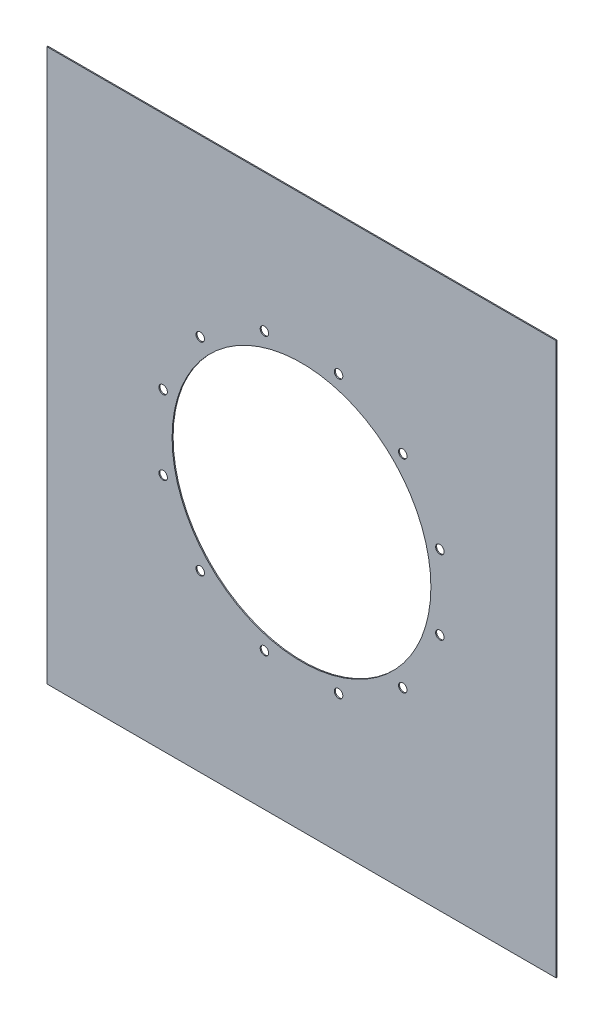
ISO-10303-21;
HEADER;
FILE_DESCRIPTION(('STEP AP214'),'2;1');
FILE_NAME('part.step','',(''),(''),'','','');
FILE_SCHEMA(('AUTOMOTIVE_DESIGN { 1 0 10303 214 1 1 1 1 }'));
ENDSEC;
DATA;
#1=APPLICATION_CONTEXT('core data for automotive mechanical design processes');
#2=APPLICATION_PROTOCOL_DEFINITION('international standard','automotive_design',2000,#1);
#3=PRODUCT_CONTEXT('',#1,'mechanical');
#4=PRODUCT('Part','Part','',(#3));
#5=PRODUCT_RELATED_PRODUCT_CATEGORY('part','',(#4));
#6=PRODUCT_DEFINITION_FORMATION('','',#4);
#7=PRODUCT_DEFINITION_CONTEXT('part definition',#1,'design');
#8=PRODUCT_DEFINITION('design','',#6,#7);
#9=PRODUCT_DEFINITION_SHAPE('','',#8);
#10=(LENGTH_UNIT() NAMED_UNIT(*) SI_UNIT(.MILLI.,.METRE.));
#11=(NAMED_UNIT(*) PLANE_ANGLE_UNIT() SI_UNIT($,.RADIAN.));
#12=(NAMED_UNIT(*) SI_UNIT($,.STERADIAN.) SOLID_ANGLE_UNIT());
#13=UNCERTAINTY_MEASURE_WITH_UNIT(LENGTH_MEASURE(1.E-05),#10,'distance_accuracy_value','');
#14=(GEOMETRIC_REPRESENTATION_CONTEXT(3) GLOBAL_UNCERTAINTY_ASSIGNED_CONTEXT((#13)) GLOBAL_UNIT_ASSIGNED_CONTEXT((#10,
#11,#12)) REPRESENTATION_CONTEXT('',''));
#15=CARTESIAN_POINT('',(0.,0.,0.));
#16=DIRECTION('',(0.,0.,1.));
#17=DIRECTION('',(1.,0.,0.));
#18=AXIS2_PLACEMENT_3D('',#15,#16,#17);
#19=CARTESIAN_POINT('',(-300.,-325.,-1.2));
#20=DIRECTION('',(-1.,0.,0.));
#21=DIRECTION('',(0.,0.,1.));
#22=AXIS2_PLACEMENT_3D('',#19,#20,#21);
#23=PLANE('',#22);
#24=DIRECTION('',(0.,-1.,0.));
#25=VECTOR('',#24,1.);
#26=CARTESIAN_POINT('',(-300.,-325.,0.));
#27=LINE('',#26,#25);
#28=CARTESIAN_POINT('',(-300.,325.,0.));
#29=VERTEX_POINT('',#28);
#30=CARTESIAN_POINT('',(-300.,-325.,0.));
#31=VERTEX_POINT('',#30);
#32=EDGE_CURVE('E108',#29,#31,#27,.T.);
#33=ORIENTED_EDGE('',*,*,#32,.F.);
#34=DIRECTION('',(0.,0.,1.));
#35=VECTOR('',#34,1.);
#36=CARTESIAN_POINT('',(-300.,325.,-1.2));
#37=LINE('',#36,#35);
#38=CARTESIAN_POINT('',(-300.,325.,-1.2));
#39=VERTEX_POINT('',#38);
#40=EDGE_CURVE('E11',#39,#29,#37,.T.);
#41=ORIENTED_EDGE('',*,*,#40,.F.);
#42=DIRECTION('',(0.,-1.,0.));
#43=VECTOR('',#42,1.);
#44=CARTESIAN_POINT('',(-300.,-325.,-1.2));
#45=LINE('',#44,#43);
#46=CARTESIAN_POINT('',(-300.,-325.,-1.2));
#47=VERTEX_POINT('',#46);
#48=EDGE_CURVE('E101',#39,#47,#45,.T.);
#49=ORIENTED_EDGE('',*,*,#48,.T.);
#50=DIRECTION('',(0.,0.,1.));
#51=VECTOR('',#50,1.);
#52=CARTESIAN_POINT('',(-300.,-325.,-1.2));
#53=LINE('',#52,#51);
#54=EDGE_CURVE('E46',#47,#31,#53,.T.);
#55=ORIENTED_EDGE('',*,*,#54,.T.);
#56=EDGE_LOOP('',(#33,#41,#49,#55));
#57=FACE_BOUND('',#56,.T.);
#58=ADVANCED_FACE('F43',(#57),#23,.T.);
#59=CARTESIAN_POINT('',(300.,325.,-1.2));
#60=DIRECTION('',(0.,1.,0.));
#61=DIRECTION('',(-1.,0.,0.));
#62=AXIS2_PLACEMENT_3D('',#59,#60,#61);
#63=PLANE('',#62);
#64=DIRECTION('',(-1.,0.,0.));
#65=VECTOR('',#64,1.);
#66=CARTESIAN_POINT('',(300.,325.,0.));
#67=LINE('',#66,#65);
#68=CARTESIAN_POINT('',(300.,325.,0.));
#69=VERTEX_POINT('',#68);
#70=EDGE_CURVE('E103',#69,#29,#67,.T.);
#71=ORIENTED_EDGE('',*,*,#70,.F.);
#72=DIRECTION('',(0.,0.,1.));
#73=VECTOR('',#72,1.);
#74=CARTESIAN_POINT('',(300.,325.,-1.2));
#75=LINE('',#74,#73);
#76=CARTESIAN_POINT('',(300.,325.,-1.2));
#77=VERTEX_POINT('',#76);
#78=EDGE_CURVE('E52',#77,#69,#75,.T.);
#79=ORIENTED_EDGE('',*,*,#78,.F.);
#80=DIRECTION('',(-1.,0.,0.));
#81=VECTOR('',#80,1.);
#82=CARTESIAN_POINT('',(300.,325.,-1.2));
#83=LINE('',#82,#81);
#84=EDGE_CURVE('E98',#77,#39,#83,.T.);
#85=ORIENTED_EDGE('',*,*,#84,.T.);
#86=ORIENTED_EDGE('',*,*,#40,.T.);
#87=EDGE_LOOP('',(#71,#79,#85,#86));
#88=FACE_BOUND('',#87,.T.);
#89=ADVANCED_FACE('F119',(#88),#63,.T.);
#90=CARTESIAN_POINT('',(300.,-325.,-1.2));
#91=DIRECTION('',(1.,0.,0.));
#92=DIRECTION('',(0.,0.,-1.));
#93=AXIS2_PLACEMENT_3D('',#90,#91,#92);
#94=PLANE('',#93);
#95=DIRECTION('',(0.,1.,0.));
#96=VECTOR('',#95,1.);
#97=CARTESIAN_POINT('',(300.,-325.,0.));
#98=LINE('',#97,#96);
#99=CARTESIAN_POINT('',(300.,-325.,0.));
#100=VERTEX_POINT('',#99);
#101=EDGE_CURVE('E93',#100,#69,#98,.T.);
#102=ORIENTED_EDGE('',*,*,#101,.F.);
#103=DIRECTION('',(0.,0.,1.));
#104=VECTOR('',#103,1.);
#105=CARTESIAN_POINT('',(300.,-325.,-1.2));
#106=LINE('',#105,#104);
#107=CARTESIAN_POINT('',(300.,-325.,-1.2));
#108=VERTEX_POINT('',#107);
#109=EDGE_CURVE('E88',#108,#100,#106,.T.);
#110=ORIENTED_EDGE('',*,*,#109,.F.);
#111=DIRECTION('',(0.,1.,0.));
#112=VECTOR('',#111,1.);
#113=CARTESIAN_POINT('',(300.,-325.,-1.2));
#114=LINE('',#113,#112);
#115=EDGE_CURVE('E91',#108,#77,#114,.T.);
#116=ORIENTED_EDGE('',*,*,#115,.T.);
#117=ORIENTED_EDGE('',*,*,#78,.T.);
#118=EDGE_LOOP('',(#102,#110,#116,#117));
#119=FACE_BOUND('',#118,.T.);
#120=ADVANCED_FACE('F90',(#119),#94,.T.);
#121=CARTESIAN_POINT('',(300.,-325.,-1.2));
#122=DIRECTION('',(0.,-1.,0.));
#123=DIRECTION('',(1.,0.,0.));
#124=AXIS2_PLACEMENT_3D('',#121,#122,#123);
#125=PLANE('',#124);
#126=DIRECTION('',(1.,0.,0.));
#127=VECTOR('',#126,1.);
#128=CARTESIAN_POINT('',(300.,-325.,0.));
#129=LINE('',#128,#127);
#130=EDGE_CURVE('E111',#31,#100,#129,.T.);
#131=ORIENTED_EDGE('',*,*,#130,.F.);
#132=ORIENTED_EDGE('',*,*,#54,.F.);
#133=DIRECTION('',(1.,0.,0.));
#134=VECTOR('',#133,1.);
#135=CARTESIAN_POINT('',(300.,-325.,-1.2));
#136=LINE('',#135,#134);
#137=EDGE_CURVE('E97',#47,#108,#136,.T.);
#138=ORIENTED_EDGE('',*,*,#137,.T.);
#139=ORIENTED_EDGE('',*,*,#109,.T.);
#140=EDGE_LOOP('',(#131,#132,#138,#139));
#141=FACE_BOUND('',#140,.T.);
#142=ADVANCED_FACE('F100',(#141),#125,.T.);
#143=CARTESIAN_POINT('',(0.,0.,-1.2));
#144=DIRECTION('',(0.,0.,1.));
#145=DIRECTION('',(1.,0.,0.));
#146=AXIS2_PLACEMENT_3D('',#143,#144,#145);
#147=PLANE('',#146);
#148=CARTESIAN_POINT('',(-43.6627729087953,162.951686894966,-1.2));
#149=DIRECTION('',(0.,0.,1.));
#150=DIRECTION('',(1.,0.,0.));
#151=AXIS2_PLACEMENT_3D('',#148,#149,#150);
#152=CIRCLE('',#151,4.99999999999998);
#153=CARTESIAN_POINT('',(-38.6627729087953,162.951686894966,-1.2));
#154=VERTEX_POINT('',#153);
#155=EDGE_CURVE('E196',#154,#154,#152,.T.);
#156=ORIENTED_EDGE('',*,*,#155,.T.);
#157=EDGE_LOOP('',(#156));
#158=FACE_BOUND('',#157,.T.);
#159=CARTESIAN_POINT('',(-119.288913986171,119.28891398617,-1.2));
#160=DIRECTION('',(0.,0.,1.));
#161=DIRECTION('',(1.,0.,0.));
#162=AXIS2_PLACEMENT_3D('',#159,#160,#161);
#163=CIRCLE('',#162,5.00000000000001);
#164=CARTESIAN_POINT('',(-114.288913986171,119.28891398617,-1.2));
#165=VERTEX_POINT('',#164);
#166=EDGE_CURVE('E204',#165,#165,#163,.T.);
#167=ORIENTED_EDGE('',*,*,#166,.T.);
#168=EDGE_LOOP('',(#167));
#169=FACE_BOUND('',#168,.T.);
#170=CARTESIAN_POINT('',(-162.951686894966,43.6627729087952,-1.2));
#171=DIRECTION('',(0.,0.,1.));
#172=DIRECTION('',(1.,0.,0.));
#173=AXIS2_PLACEMENT_3D('',#170,#171,#172);
#174=CIRCLE('',#173,5.00000000000002);
#175=CARTESIAN_POINT('',(-157.951686894966,43.6627729087952,-1.2));
#176=VERTEX_POINT('',#175);
#177=EDGE_CURVE('E210',#176,#176,#174,.T.);
#178=ORIENTED_EDGE('',*,*,#177,.T.);
#179=EDGE_LOOP('',(#178));
#180=FACE_BOUND('',#179,.T.);
#181=CARTESIAN_POINT('',(-162.951686894966,-43.6627729087953,-1.2));
#182=DIRECTION('',(0.,0.,1.));
#183=DIRECTION('',(1.,0.,0.));
#184=AXIS2_PLACEMENT_3D('',#181,#182,#183);
#185=CIRCLE('',#184,4.99999999999999);
#186=CARTESIAN_POINT('',(-157.951686894966,-43.6627729087953,-1.2));
#187=VERTEX_POINT('',#186);
#188=EDGE_CURVE('E216',#187,#187,#185,.T.);
#189=ORIENTED_EDGE('',*,*,#188,.T.);
#190=EDGE_LOOP('',(#189));
#191=FACE_BOUND('',#190,.T.);
#192=CARTESIAN_POINT('',(-119.288913986171,-119.288913986171,-1.2));
#193=DIRECTION('',(0.,0.,1.));
#194=DIRECTION('',(1.,0.,0.));
#195=AXIS2_PLACEMENT_3D('',#192,#193,#194);
#196=CIRCLE('',#195,4.99999999999999);
#197=CARTESIAN_POINT('',(-114.288913986171,-119.288913986171,-1.2));
#198=VERTEX_POINT('',#197);
#199=EDGE_CURVE('E222',#198,#198,#196,.T.);
#200=ORIENTED_EDGE('',*,*,#199,.T.);
#201=EDGE_LOOP('',(#200));
#202=FACE_BOUND('',#201,.T.);
#203=CARTESIAN_POINT('',(-43.6627729087952,-162.951686894966,-1.2));
#204=DIRECTION('',(0.,0.,1.));
#205=DIRECTION('',(1.,0.,0.));
#206=AXIS2_PLACEMENT_3D('',#203,#204,#205);
#207=CIRCLE('',#206,4.99999999999999);
#208=CARTESIAN_POINT('',(-38.6627729087952,-162.951686894966,-1.2));
#209=VERTEX_POINT('',#208);
#210=EDGE_CURVE('E228',#209,#209,#207,.T.);
#211=ORIENTED_EDGE('',*,*,#210,.T.);
#212=EDGE_LOOP('',(#211));
#213=FACE_BOUND('',#212,.T.);
#214=CARTESIAN_POINT('',(43.6627729087953,-162.951686894966,-1.2));
#215=DIRECTION('',(0.,0.,1.));
#216=DIRECTION('',(1.,0.,0.));
#217=AXIS2_PLACEMENT_3D('',#214,#215,#216);
#218=CIRCLE('',#217,5.);
#219=CARTESIAN_POINT('',(48.6627729087953,-162.951686894966,-1.2));
#220=VERTEX_POINT('',#219);
#221=EDGE_CURVE('E234',#220,#220,#218,.T.);
#222=ORIENTED_EDGE('',*,*,#221,.T.);
#223=EDGE_LOOP('',(#222));
#224=FACE_BOUND('',#223,.T.);
#225=CARTESIAN_POINT('',(119.288913986171,-119.288913986171,-1.2));
#226=DIRECTION('',(0.,0.,1.));
#227=DIRECTION('',(1.,0.,0.));
#228=AXIS2_PLACEMENT_3D('',#225,#226,#227);
#229=CIRCLE('',#228,5.00000000000002);
#230=CARTESIAN_POINT('',(124.288913986171,-119.288913986171,-1.2));
#231=VERTEX_POINT('',#230);
#232=EDGE_CURVE('E240',#231,#231,#229,.T.);
#233=ORIENTED_EDGE('',*,*,#232,.T.);
#234=EDGE_LOOP('',(#233));
#235=FACE_BOUND('',#234,.T.);
#236=CARTESIAN_POINT('',(162.951686894966,-43.6627729087953,-1.2));
#237=DIRECTION('',(0.,0.,1.));
#238=DIRECTION('',(1.,0.,0.));
#239=AXIS2_PLACEMENT_3D('',#236,#237,#238);
#240=CIRCLE('',#239,5.00000000000002);
#241=CARTESIAN_POINT('',(167.951686894966,-43.6627729087953,-1.2));
#242=VERTEX_POINT('',#241);
#243=EDGE_CURVE('E246',#242,#242,#240,.T.);
#244=ORIENTED_EDGE('',*,*,#243,.T.);
#245=EDGE_LOOP('',(#244));
#246=FACE_BOUND('',#245,.T.);
#247=CARTESIAN_POINT('',(162.951686894966,43.6627729087952,-1.2));
#248=DIRECTION('',(0.,0.,1.));
#249=DIRECTION('',(1.,0.,0.));
#250=AXIS2_PLACEMENT_3D('',#247,#248,#249);
#251=CIRCLE('',#250,5.00000000000002);
#252=CARTESIAN_POINT('',(167.951686894966,43.6627729087952,-1.2));
#253=VERTEX_POINT('',#252);
#254=EDGE_CURVE('E252',#253,#253,#251,.T.);
#255=ORIENTED_EDGE('',*,*,#254,.T.);
#256=EDGE_LOOP('',(#255));
#257=FACE_BOUND('',#256,.T.);
#258=CARTESIAN_POINT('',(119.288913986171,119.28891398617,-1.2));
#259=DIRECTION('',(0.,0.,1.));
#260=DIRECTION('',(1.,0.,0.));
#261=AXIS2_PLACEMENT_3D('',#258,#259,#260);
#262=CIRCLE('',#261,4.99999999999999);
#263=CARTESIAN_POINT('',(124.288913986171,119.28891398617,-1.2));
#264=VERTEX_POINT('',#263);
#265=EDGE_CURVE('E258',#264,#264,#262,.T.);
#266=ORIENTED_EDGE('',*,*,#265,.T.);
#267=EDGE_LOOP('',(#266));
#268=FACE_BOUND('',#267,.T.);
#269=CARTESIAN_POINT('',(43.6627729087953,162.951686894966,-1.2));
#270=DIRECTION('',(0.,0.,1.));
#271=DIRECTION('',(1.,0.,0.));
#272=AXIS2_PLACEMENT_3D('',#269,#270,#271);
#273=CIRCLE('',#272,5.);
#274=CARTESIAN_POINT('',(48.6627729087953,162.951686894966,-1.2));
#275=VERTEX_POINT('',#274);
#276=EDGE_CURVE('E264',#275,#275,#273,.T.);
#277=ORIENTED_EDGE('',*,*,#276,.T.);
#278=EDGE_LOOP('',(#277));
#279=FACE_BOUND('',#278,.T.);
#280=CARTESIAN_POINT('',(0.,0.,-1.2));
#281=DIRECTION('',(0.,0.,1.));
#282=DIRECTION('',(1.,0.,0.));
#283=AXIS2_PLACEMENT_3D('',#280,#281,#282);
#284=CIRCLE('',#283,152.4);
#285=CARTESIAN_POINT('',(152.4,0.,-1.2));
#286=VERTEX_POINT('',#285);
#287=EDGE_CURVE('E112',#286,#286,#284,.T.);
#288=ORIENTED_EDGE('',*,*,#287,.T.);
#289=EDGE_LOOP('',(#288));
#290=FACE_BOUND('',#289,.T.);
#291=ORIENTED_EDGE('',*,*,#48,.F.);
#292=ORIENTED_EDGE('',*,*,#84,.F.);
#293=ORIENTED_EDGE('',*,*,#115,.F.);
#294=ORIENTED_EDGE('',*,*,#137,.F.);
#295=EDGE_LOOP('',(#291,#292,#293,#294));
#296=FACE_BOUND('',#295,.T.);
#297=ADVANCED_FACE('F96',(#158,#169,#180,#191,#202,#213,#224,#235,#246,#257,#268,#279,#290,
#296),#147,.F.);
#298=CARTESIAN_POINT('',(0.,0.,0.));
#299=DIRECTION('',(0.,0.,1.));
#300=DIRECTION('',(1.,0.,0.));
#301=AXIS2_PLACEMENT_3D('',#298,#299,#300);
#302=PLANE('',#301);
#303=CARTESIAN_POINT('',(-43.6627729087953,162.951686894966,0.));
#304=DIRECTION('',(0.,0.,1.));
#305=DIRECTION('',(1.,0.,0.));
#306=AXIS2_PLACEMENT_3D('',#303,#304,#305);
#307=CIRCLE('',#306,4.99999999999998);
#308=CARTESIAN_POINT('',(-38.6627729087953,162.951686894966,0.));
#309=VERTEX_POINT('',#308);
#310=EDGE_CURVE('E199',#309,#309,#307,.T.);
#311=ORIENTED_EDGE('',*,*,#310,.F.);
#312=EDGE_LOOP('',(#311));
#313=FACE_BOUND('',#312,.T.);
#314=CARTESIAN_POINT('',(-119.288913986171,119.28891398617,0.));
#315=DIRECTION('',(0.,0.,1.));
#316=DIRECTION('',(1.,0.,0.));
#317=AXIS2_PLACEMENT_3D('',#314,#315,#316);
#318=CIRCLE('',#317,5.00000000000001);
#319=CARTESIAN_POINT('',(-114.288913986171,119.28891398617,0.));
#320=VERTEX_POINT('',#319);
#321=EDGE_CURVE('E201',#320,#320,#318,.T.);
#322=ORIENTED_EDGE('',*,*,#321,.F.);
#323=EDGE_LOOP('',(#322));
#324=FACE_BOUND('',#323,.T.);
#325=CARTESIAN_POINT('',(-162.951686894966,43.6627729087952,0.));
#326=DIRECTION('',(0.,0.,1.));
#327=DIRECTION('',(1.,0.,0.));
#328=AXIS2_PLACEMENT_3D('',#325,#326,#327);
#329=CIRCLE('',#328,5.00000000000002);
#330=CARTESIAN_POINT('',(-157.951686894966,43.6627729087952,0.));
#331=VERTEX_POINT('',#330);
#332=EDGE_CURVE('E207',#331,#331,#329,.T.);
#333=ORIENTED_EDGE('',*,*,#332,.F.);
#334=EDGE_LOOP('',(#333));
#335=FACE_BOUND('',#334,.T.);
#336=CARTESIAN_POINT('',(-162.951686894966,-43.6627729087953,0.));
#337=DIRECTION('',(0.,0.,1.));
#338=DIRECTION('',(1.,0.,0.));
#339=AXIS2_PLACEMENT_3D('',#336,#337,#338);
#340=CIRCLE('',#339,4.99999999999999);
#341=CARTESIAN_POINT('',(-157.951686894966,-43.6627729087953,0.));
#342=VERTEX_POINT('',#341);
#343=EDGE_CURVE('E213',#342,#342,#340,.T.);
#344=ORIENTED_EDGE('',*,*,#343,.F.);
#345=EDGE_LOOP('',(#344));
#346=FACE_BOUND('',#345,.T.);
#347=CARTESIAN_POINT('',(-119.288913986171,-119.288913986171,0.));
#348=DIRECTION('',(0.,0.,1.));
#349=DIRECTION('',(1.,0.,0.));
#350=AXIS2_PLACEMENT_3D('',#347,#348,#349);
#351=CIRCLE('',#350,4.99999999999999);
#352=CARTESIAN_POINT('',(-114.288913986171,-119.288913986171,0.));
#353=VERTEX_POINT('',#352);
#354=EDGE_CURVE('E219',#353,#353,#351,.T.);
#355=ORIENTED_EDGE('',*,*,#354,.F.);
#356=EDGE_LOOP('',(#355));
#357=FACE_BOUND('',#356,.T.);
#358=CARTESIAN_POINT('',(-43.6627729087952,-162.951686894966,0.));
#359=DIRECTION('',(0.,0.,1.));
#360=DIRECTION('',(1.,0.,0.));
#361=AXIS2_PLACEMENT_3D('',#358,#359,#360);
#362=CIRCLE('',#361,4.99999999999999);
#363=CARTESIAN_POINT('',(-38.6627729087952,-162.951686894966,0.));
#364=VERTEX_POINT('',#363);
#365=EDGE_CURVE('E225',#364,#364,#362,.T.);
#366=ORIENTED_EDGE('',*,*,#365,.F.);
#367=EDGE_LOOP('',(#366));
#368=FACE_BOUND('',#367,.T.);
#369=CARTESIAN_POINT('',(43.6627729087953,-162.951686894966,0.));
#370=DIRECTION('',(0.,0.,1.));
#371=DIRECTION('',(1.,0.,0.));
#372=AXIS2_PLACEMENT_3D('',#369,#370,#371);
#373=CIRCLE('',#372,5.);
#374=CARTESIAN_POINT('',(48.6627729087953,-162.951686894966,0.));
#375=VERTEX_POINT('',#374);
#376=EDGE_CURVE('E231',#375,#375,#373,.T.);
#377=ORIENTED_EDGE('',*,*,#376,.F.);
#378=EDGE_LOOP('',(#377));
#379=FACE_BOUND('',#378,.T.);
#380=CARTESIAN_POINT('',(119.288913986171,-119.288913986171,0.));
#381=DIRECTION('',(0.,0.,1.));
#382=DIRECTION('',(1.,0.,0.));
#383=AXIS2_PLACEMENT_3D('',#380,#381,#382);
#384=CIRCLE('',#383,5.00000000000002);
#385=CARTESIAN_POINT('',(124.288913986171,-119.288913986171,0.));
#386=VERTEX_POINT('',#385);
#387=EDGE_CURVE('E237',#386,#386,#384,.T.);
#388=ORIENTED_EDGE('',*,*,#387,.F.);
#389=EDGE_LOOP('',(#388));
#390=FACE_BOUND('',#389,.T.);
#391=CARTESIAN_POINT('',(162.951686894966,-43.6627729087953,0.));
#392=DIRECTION('',(0.,0.,1.));
#393=DIRECTION('',(1.,0.,0.));
#394=AXIS2_PLACEMENT_3D('',#391,#392,#393);
#395=CIRCLE('',#394,5.00000000000002);
#396=CARTESIAN_POINT('',(167.951686894966,-43.6627729087953,0.));
#397=VERTEX_POINT('',#396);
#398=EDGE_CURVE('E243',#397,#397,#395,.T.);
#399=ORIENTED_EDGE('',*,*,#398,.F.);
#400=EDGE_LOOP('',(#399));
#401=FACE_BOUND('',#400,.T.);
#402=CARTESIAN_POINT('',(162.951686894966,43.6627729087952,0.));
#403=DIRECTION('',(0.,0.,1.));
#404=DIRECTION('',(1.,0.,0.));
#405=AXIS2_PLACEMENT_3D('',#402,#403,#404);
#406=CIRCLE('',#405,5.00000000000002);
#407=CARTESIAN_POINT('',(167.951686894966,43.6627729087952,0.));
#408=VERTEX_POINT('',#407);
#409=EDGE_CURVE('E249',#408,#408,#406,.T.);
#410=ORIENTED_EDGE('',*,*,#409,.F.);
#411=EDGE_LOOP('',(#410));
#412=FACE_BOUND('',#411,.T.);
#413=CARTESIAN_POINT('',(119.288913986171,119.28891398617,0.));
#414=DIRECTION('',(0.,0.,1.));
#415=DIRECTION('',(1.,0.,0.));
#416=AXIS2_PLACEMENT_3D('',#413,#414,#415);
#417=CIRCLE('',#416,4.99999999999999);
#418=CARTESIAN_POINT('',(124.288913986171,119.28891398617,0.));
#419=VERTEX_POINT('',#418);
#420=EDGE_CURVE('E255',#419,#419,#417,.T.);
#421=ORIENTED_EDGE('',*,*,#420,.F.);
#422=EDGE_LOOP('',(#421));
#423=FACE_BOUND('',#422,.T.);
#424=CARTESIAN_POINT('',(43.6627729087953,162.951686894966,0.));
#425=DIRECTION('',(0.,0.,1.));
#426=DIRECTION('',(1.,0.,0.));
#427=AXIS2_PLACEMENT_3D('',#424,#425,#426);
#428=CIRCLE('',#427,5.);
#429=CARTESIAN_POINT('',(48.6627729087953,162.951686894966,0.));
#430=VERTEX_POINT('',#429);
#431=EDGE_CURVE('E261',#430,#430,#428,.T.);
#432=ORIENTED_EDGE('',*,*,#431,.F.);
#433=EDGE_LOOP('',(#432));
#434=FACE_BOUND('',#433,.T.);
#435=CARTESIAN_POINT('',(0.,0.,0.));
#436=DIRECTION('',(0.,0.,1.));
#437=DIRECTION('',(1.,0.,0.));
#438=AXIS2_PLACEMENT_3D('',#435,#436,#437);
#439=CIRCLE('',#438,152.4);
#440=CARTESIAN_POINT('',(152.4,0.,0.));
#441=VERTEX_POINT('',#440);
#442=EDGE_CURVE('E267',#441,#441,#439,.T.);
#443=ORIENTED_EDGE('',*,*,#442,.F.);
#444=EDGE_LOOP('',(#443));
#445=FACE_BOUND('',#444,.T.);
#446=ORIENTED_EDGE('',*,*,#32,.T.);
#447=ORIENTED_EDGE('',*,*,#130,.T.);
#448=ORIENTED_EDGE('',*,*,#101,.T.);
#449=ORIENTED_EDGE('',*,*,#70,.T.);
#450=EDGE_LOOP('',(#446,#447,#448,#449));
#451=FACE_BOUND('',#450,.T.);
#452=ADVANCED_FACE('F118',(#313,#324,#335,#346,#357,#368,#379,#390,#401,#412,#423,#434,#445,
#451),#302,.T.);
#453=CARTESIAN_POINT('',(0.,0.,-1.2));
#454=DIRECTION('',(0.,0.,1.));
#455=DIRECTION('',(1.,0.,0.));
#456=AXIS2_PLACEMENT_3D('',#453,#454,#455);
#457=CYLINDRICAL_SURFACE('',#456,152.4);
#458=ORIENTED_EDGE('',*,*,#287,.F.);
#459=EDGE_LOOP('',(#458));
#460=FACE_BOUND('',#459,.T.);
#461=ORIENTED_EDGE('',*,*,#442,.T.);
#462=EDGE_LOOP('',(#461));
#463=FACE_BOUND('',#462,.T.);
#464=ADVANCED_FACE('F137',(#460,#463),#457,.F.);
#465=CARTESIAN_POINT('',(43.6627729087953,162.951686894966,-1.2));
#466=DIRECTION('',(0.,0.,1.));
#467=DIRECTION('',(1.,0.,0.));
#468=AXIS2_PLACEMENT_3D('',#465,#466,#467);
#469=CYLINDRICAL_SURFACE('',#468,5.);
#470=ORIENTED_EDGE('',*,*,#276,.F.);
#471=EDGE_LOOP('',(#470));
#472=FACE_BOUND('',#471,.T.);
#473=ORIENTED_EDGE('',*,*,#431,.T.);
#474=EDGE_LOOP('',(#473));
#475=FACE_BOUND('',#474,.T.);
#476=ADVANCED_FACE('F144',(#472,#475),#469,.F.);
#477=CARTESIAN_POINT('',(119.288913986171,119.28891398617,-1.2));
#478=DIRECTION('',(0.,0.,1.));
#479=DIRECTION('',(1.,0.,0.));
#480=AXIS2_PLACEMENT_3D('',#477,#478,#479);
#481=CYLINDRICAL_SURFACE('',#480,4.99999999999999);
#482=ORIENTED_EDGE('',*,*,#265,.F.);
#483=EDGE_LOOP('',(#482));
#484=FACE_BOUND('',#483,.T.);
#485=ORIENTED_EDGE('',*,*,#420,.T.);
#486=EDGE_LOOP('',(#485));
#487=FACE_BOUND('',#486,.T.);
#488=ADVANCED_FACE('F148',(#484,#487),#481,.F.);
#489=CARTESIAN_POINT('',(162.951686894966,43.6627729087952,-1.2));
#490=DIRECTION('',(0.,0.,1.));
#491=DIRECTION('',(1.,0.,0.));
#492=AXIS2_PLACEMENT_3D('',#489,#490,#491);
#493=CYLINDRICAL_SURFACE('',#492,5.00000000000002);
#494=ORIENTED_EDGE('',*,*,#254,.F.);
#495=EDGE_LOOP('',(#494));
#496=FACE_BOUND('',#495,.T.);
#497=ORIENTED_EDGE('',*,*,#409,.T.);
#498=EDGE_LOOP('',(#497));
#499=FACE_BOUND('',#498,.T.);
#500=ADVANCED_FACE('F152',(#496,#499),#493,.F.);
#501=CARTESIAN_POINT('',(162.951686894966,-43.6627729087953,-1.2));
#502=DIRECTION('',(0.,0.,1.));
#503=DIRECTION('',(1.,0.,0.));
#504=AXIS2_PLACEMENT_3D('',#501,#502,#503);
#505=CYLINDRICAL_SURFACE('',#504,5.00000000000002);
#506=ORIENTED_EDGE('',*,*,#243,.F.);
#507=EDGE_LOOP('',(#506));
#508=FACE_BOUND('',#507,.T.);
#509=ORIENTED_EDGE('',*,*,#398,.T.);
#510=EDGE_LOOP('',(#509));
#511=FACE_BOUND('',#510,.T.);
#512=ADVANCED_FACE('F156',(#508,#511),#505,.F.);
#513=CARTESIAN_POINT('',(119.288913986171,-119.288913986171,-1.2));
#514=DIRECTION('',(0.,0.,1.));
#515=DIRECTION('',(1.,0.,0.));
#516=AXIS2_PLACEMENT_3D('',#513,#514,#515);
#517=CYLINDRICAL_SURFACE('',#516,5.00000000000002);
#518=ORIENTED_EDGE('',*,*,#232,.F.);
#519=EDGE_LOOP('',(#518));
#520=FACE_BOUND('',#519,.T.);
#521=ORIENTED_EDGE('',*,*,#387,.T.);
#522=EDGE_LOOP('',(#521));
#523=FACE_BOUND('',#522,.T.);
#524=ADVANCED_FACE('F160',(#520,#523),#517,.F.);
#525=CARTESIAN_POINT('',(43.6627729087953,-162.951686894966,-1.2));
#526=DIRECTION('',(0.,0.,1.));
#527=DIRECTION('',(1.,0.,0.));
#528=AXIS2_PLACEMENT_3D('',#525,#526,#527);
#529=CYLINDRICAL_SURFACE('',#528,5.);
#530=ORIENTED_EDGE('',*,*,#221,.F.);
#531=EDGE_LOOP('',(#530));
#532=FACE_BOUND('',#531,.T.);
#533=ORIENTED_EDGE('',*,*,#376,.T.);
#534=EDGE_LOOP('',(#533));
#535=FACE_BOUND('',#534,.T.);
#536=ADVANCED_FACE('F164',(#532,#535),#529,.F.);
#537=CARTESIAN_POINT('',(-43.6627729087952,-162.951686894966,-1.2));
#538=DIRECTION('',(0.,0.,1.));
#539=DIRECTION('',(1.,0.,0.));
#540=AXIS2_PLACEMENT_3D('',#537,#538,#539);
#541=CYLINDRICAL_SURFACE('',#540,4.99999999999999);
#542=ORIENTED_EDGE('',*,*,#210,.F.);
#543=EDGE_LOOP('',(#542));
#544=FACE_BOUND('',#543,.T.);
#545=ORIENTED_EDGE('',*,*,#365,.T.);
#546=EDGE_LOOP('',(#545));
#547=FACE_BOUND('',#546,.T.);
#548=ADVANCED_FACE('F168',(#544,#547),#541,.F.);
#549=CARTESIAN_POINT('',(-119.288913986171,-119.288913986171,-1.2));
#550=DIRECTION('',(0.,0.,1.));
#551=DIRECTION('',(1.,0.,0.));
#552=AXIS2_PLACEMENT_3D('',#549,#550,#551);
#553=CYLINDRICAL_SURFACE('',#552,4.99999999999999);
#554=ORIENTED_EDGE('',*,*,#199,.F.);
#555=EDGE_LOOP('',(#554));
#556=FACE_BOUND('',#555,.T.);
#557=ORIENTED_EDGE('',*,*,#354,.T.);
#558=EDGE_LOOP('',(#557));
#559=FACE_BOUND('',#558,.T.);
#560=ADVANCED_FACE('F172',(#556,#559),#553,.F.);
#561=CARTESIAN_POINT('',(-162.951686894966,-43.6627729087953,-1.2));
#562=DIRECTION('',(0.,0.,1.));
#563=DIRECTION('',(1.,0.,0.));
#564=AXIS2_PLACEMENT_3D('',#561,#562,#563);
#565=CYLINDRICAL_SURFACE('',#564,4.99999999999999);
#566=ORIENTED_EDGE('',*,*,#188,.F.);
#567=EDGE_LOOP('',(#566));
#568=FACE_BOUND('',#567,.T.);
#569=ORIENTED_EDGE('',*,*,#343,.T.);
#570=EDGE_LOOP('',(#569));
#571=FACE_BOUND('',#570,.T.);
#572=ADVANCED_FACE('F176',(#568,#571),#565,.F.);
#573=CARTESIAN_POINT('',(-162.951686894966,43.6627729087952,-1.2));
#574=DIRECTION('',(0.,0.,1.));
#575=DIRECTION('',(1.,0.,0.));
#576=AXIS2_PLACEMENT_3D('',#573,#574,#575);
#577=CYLINDRICAL_SURFACE('',#576,5.00000000000002);
#578=ORIENTED_EDGE('',*,*,#177,.F.);
#579=EDGE_LOOP('',(#578));
#580=FACE_BOUND('',#579,.T.);
#581=ORIENTED_EDGE('',*,*,#332,.T.);
#582=EDGE_LOOP('',(#581));
#583=FACE_BOUND('',#582,.T.);
#584=ADVANCED_FACE('F180',(#580,#583),#577,.F.);
#585=CARTESIAN_POINT('',(-119.288913986171,119.28891398617,-1.2));
#586=DIRECTION('',(0.,0.,1.));
#587=DIRECTION('',(1.,0.,0.));
#588=AXIS2_PLACEMENT_3D('',#585,#586,#587);
#589=CYLINDRICAL_SURFACE('',#588,5.00000000000001);
#590=ORIENTED_EDGE('',*,*,#166,.F.);
#591=EDGE_LOOP('',(#590));
#592=FACE_BOUND('',#591,.T.);
#593=ORIENTED_EDGE('',*,*,#321,.T.);
#594=EDGE_LOOP('',(#593));
#595=FACE_BOUND('',#594,.T.);
#596=ADVANCED_FACE('F184',(#592,#595),#589,.F.);
#597=CARTESIAN_POINT('',(-43.6627729087953,162.951686894966,-1.2));
#598=DIRECTION('',(0.,0.,1.));
#599=DIRECTION('',(1.,0.,0.));
#600=AXIS2_PLACEMENT_3D('',#597,#598,#599);
#601=CYLINDRICAL_SURFACE('',#600,4.99999999999998);
#602=ORIENTED_EDGE('',*,*,#155,.F.);
#603=EDGE_LOOP('',(#602));
#604=FACE_BOUND('',#603,.T.);
#605=ORIENTED_EDGE('',*,*,#310,.T.);
#606=EDGE_LOOP('',(#605));
#607=FACE_BOUND('',#606,.T.);
#608=ADVANCED_FACE('F188',(#604,#607),#601,.F.);
#609=CLOSED_SHELL('',(#58,#89,#120,#142,#297,#452,#464,#476,#488,#500,#512,#524,#536,#548,#560,
#572,#584,#596,#608));
#610=MANIFOLD_SOLID_BREP('B2',#609);
#611=ADVANCED_BREP_SHAPE_REPRESENTATION('',(#18,#610),#14);
#612=SHAPE_DEFINITION_REPRESENTATION(#9,#611);
ENDSEC;
END-ISO-10303-21;
